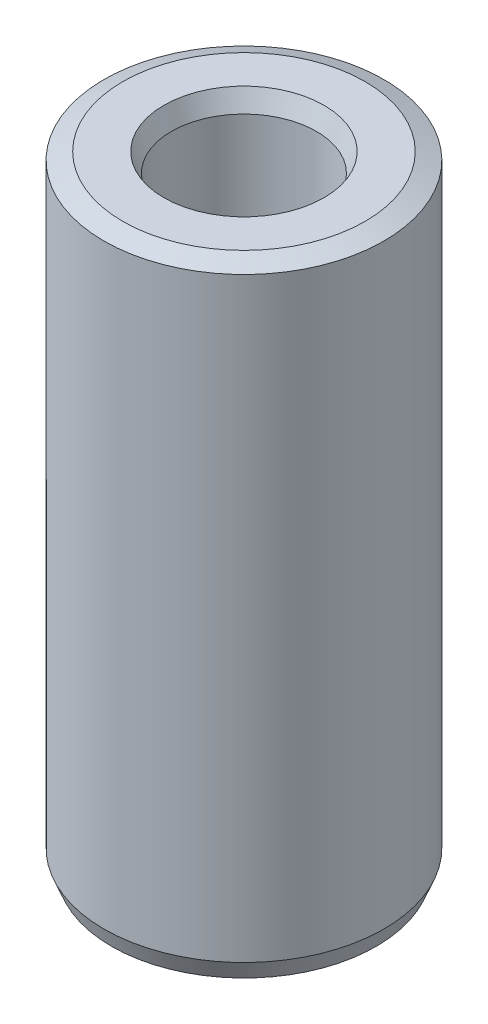
ISO-10303-21;
HEADER;
FILE_DESCRIPTION(('STEP AP214'),'2;1');
FILE_NAME('part.step','',(''),(''),'','','');
FILE_SCHEMA(('AUTOMOTIVE_DESIGN { 1 0 10303 214 1 1 1 1 }'));
ENDSEC;
DATA;
#1=APPLICATION_CONTEXT('core data for automotive mechanical design processes');
#2=APPLICATION_PROTOCOL_DEFINITION('international standard','automotive_design',2000,#1);
#3=PRODUCT_CONTEXT('',#1,'mechanical');
#4=PRODUCT('Part','Part','',(#3));
#5=PRODUCT_RELATED_PRODUCT_CATEGORY('part','',(#4));
#6=PRODUCT_DEFINITION_FORMATION('','',#4);
#7=PRODUCT_DEFINITION_CONTEXT('part definition',#1,'design');
#8=PRODUCT_DEFINITION('design','',#6,#7);
#9=PRODUCT_DEFINITION_SHAPE('','',#8);
#10=(LENGTH_UNIT() NAMED_UNIT(*) SI_UNIT(.MILLI.,.METRE.));
#11=(NAMED_UNIT(*) PLANE_ANGLE_UNIT() SI_UNIT($,.RADIAN.));
#12=(NAMED_UNIT(*) SI_UNIT($,.STERADIAN.) SOLID_ANGLE_UNIT());
#13=UNCERTAINTY_MEASURE_WITH_UNIT(LENGTH_MEASURE(1.E-05),#10,'distance_accuracy_value','');
#14=(GEOMETRIC_REPRESENTATION_CONTEXT(3) GLOBAL_UNCERTAINTY_ASSIGNED_CONTEXT((#13)) GLOBAL_UNIT_ASSIGNED_CONTEXT((#10,
#11,#12)) REPRESENTATION_CONTEXT('',''));
#15=CARTESIAN_POINT('',(0.,0.,0.));
#16=DIRECTION('',(0.,0.,1.));
#17=DIRECTION('',(1.,0.,0.));
#18=AXIS2_PLACEMENT_3D('',#15,#16,#17);
#19=CARTESIAN_POINT('',(0.,144.508683664438,0.));
#20=DIRECTION('',(0.,-1.,0.));
#21=DIRECTION('',(0.,0.,-1.));
#22=AXIS2_PLACEMENT_3D('',#19,#20,#21);
#23=CYLINDRICAL_SURFACE('',#22,32.5);
#24=CARTESIAN_POINT('',(0.,4.36969386151803,0.));
#25=DIRECTION('',(0.,1.,0.));
#26=DIRECTION('',(0.,0.,1.));
#27=AXIS2_PLACEMENT_3D('',#24,#25,#26);
#28=CIRCLE('',#27,32.5);
#29=CARTESIAN_POINT('',(0.,4.36969386151803,32.5));
#30=VERTEX_POINT('',#29);
#31=EDGE_CURVE('E10',#30,#30,#28,.T.);
#32=ORIENTED_EDGE('',*,*,#31,.T.);
#33=EDGE_LOOP('',(#32));
#34=FACE_BOUND('',#33,.T.);
#35=CARTESIAN_POINT('',(0.,142.746450942255,0.));
#36=DIRECTION('',(0.,1.,0.));
#37=DIRECTION('',(0.,0.,1.));
#38=AXIS2_PLACEMENT_3D('',#35,#36,#37);
#39=CIRCLE('',#38,32.5);
#40=CARTESIAN_POINT('',(0.,142.746450942255,32.5));
#41=VERTEX_POINT('',#40);
#42=EDGE_CURVE('E50',#41,#41,#39,.F.);
#43=ORIENTED_EDGE('',*,*,#42,.T.);
#44=EDGE_LOOP('',(#43));
#45=FACE_BOUND('',#44,.T.);
#46=ADVANCED_FACE('F39',(#34,#45),#23,.T.);
#47=CARTESIAN_POINT('',(0.,144.508683664438,0.));
#48=DIRECTION('',(0.,1.,0.));
#49=DIRECTION('',(0.,0.,1.));
#50=AXIS2_PLACEMENT_3D('',#47,#48,#49);
#51=PLANE('',#50);
#52=CARTESIAN_POINT('',(0.,144.508683664438,0.));
#53=DIRECTION('',(0.,1.,0.));
#54=DIRECTION('',(0.,0.,1.));
#55=AXIS2_PLACEMENT_3D('',#52,#53,#54);
#56=CIRCLE('',#55,18.5996014869327);
#57=CARTESIAN_POINT('',(0.,144.508683664438,18.5996014869327));
#58=VERTEX_POINT('',#57);
#59=EDGE_CURVE('E58',#58,#58,#56,.F.);
#60=ORIENTED_EDGE('',*,*,#59,.T.);
#61=EDGE_LOOP('',(#60));
#62=FACE_BOUND('',#61,.T.);
#63=CARTESIAN_POINT('',(0.,144.508683664438,0.));
#64=DIRECTION('',(0.,1.,0.));
#65=DIRECTION('',(0.,0.,1.));
#66=AXIS2_PLACEMENT_3D('',#63,#64,#65);
#67=CIRCLE('',#66,28.1303061384821);
#68=CARTESIAN_POINT('',(0.,144.508683664438,28.1303061384821));
#69=VERTEX_POINT('',#68);
#70=EDGE_CURVE('E61',#69,#69,#67,.T.);
#71=ORIENTED_EDGE('',*,*,#70,.T.);
#72=EDGE_LOOP('',(#71));
#73=FACE_BOUND('',#72,.T.);
#74=ADVANCED_FACE('F88',(#62,#73),#51,.T.);
#75=CARTESIAN_POINT('',(0.,0.,0.));
#76=DIRECTION('',(0.,1.,0.));
#77=DIRECTION('',(0.,0.,1.));
#78=AXIS2_PLACEMENT_3D('',#75,#76,#77);
#79=PLANE('',#78);
#80=CARTESIAN_POINT('',(0.,0.,0.));
#81=DIRECTION('',(0.,1.,0.));
#82=DIRECTION('',(0.,0.,1.));
#83=AXIS2_PLACEMENT_3D('',#80,#81,#82);
#84=CIRCLE('',#83,21.2070626262679);
#85=CARTESIAN_POINT('',(0.,0.,21.2070626262679));
#86=VERTEX_POINT('',#85);
#87=EDGE_CURVE('E51',#86,#86,#84,.T.);
#88=ORIENTED_EDGE('',*,*,#87,.T.);
#89=EDGE_LOOP('',(#88));
#90=FACE_BOUND('',#89,.T.);
#91=CARTESIAN_POINT('',(0.,0.,0.));
#92=DIRECTION('',(0.,1.,0.));
#93=DIRECTION('',(0.,0.,1.));
#94=AXIS2_PLACEMENT_3D('',#91,#92,#93);
#95=CIRCLE('',#94,30.7377672778172);
#96=CARTESIAN_POINT('',(0.,0.,30.7377672778172));
#97=VERTEX_POINT('',#96);
#98=EDGE_CURVE('E54',#97,#97,#95,.F.);
#99=ORIENTED_EDGE('',*,*,#98,.T.);
#100=EDGE_LOOP('',(#99));
#101=FACE_BOUND('',#100,.T.);
#102=ADVANCED_FACE('F83',(#90,#101),#79,.F.);
#103=CARTESIAN_POINT('',(0.,144.508683664438,0.));
#104=DIRECTION('',(0.,-1.,0.));
#105=DIRECTION('',(0.,0.,-1.));
#106=AXIS2_PLACEMENT_3D('',#103,#104,#105);
#107=CYLINDRICAL_SURFACE('',#106,16.8373687647499);
#108=CARTESIAN_POINT('',(0.,140.13898980292,0.));
#109=DIRECTION('',(0.,1.,0.));
#110=DIRECTION('',(0.,0.,1.));
#111=AXIS2_PLACEMENT_3D('',#108,#109,#110);
#112=CIRCLE('',#111,16.8373687647499);
#113=CARTESIAN_POINT('',(0.,140.13898980292,16.8373687647499));
#114=VERTEX_POINT('',#113);
#115=EDGE_CURVE('E67',#114,#114,#112,.T.);
#116=ORIENTED_EDGE('',*,*,#115,.T.);
#117=EDGE_LOOP('',(#116));
#118=FACE_BOUND('',#117,.T.);
#119=CARTESIAN_POINT('',(0.,1.76223272218276,0.));
#120=DIRECTION('',(0.,1.,0.));
#121=DIRECTION('',(0.,0.,1.));
#122=AXIS2_PLACEMENT_3D('',#119,#120,#121);
#123=CIRCLE('',#122,16.8373687647499);
#124=CARTESIAN_POINT('',(0.,1.76223272218276,16.8373687647499));
#125=VERTEX_POINT('',#124);
#126=EDGE_CURVE('E69',#125,#125,#123,.F.);
#127=ORIENTED_EDGE('',*,*,#126,.T.);
#128=EDGE_LOOP('',(#127));
#129=FACE_BOUND('',#128,.T.);
#130=ADVANCED_FACE('F71',(#118,#129),#107,.F.);
#131=CARTESIAN_POINT('',(0.,140.13898980292,0.));
#132=DIRECTION('',(0.,1.,0.));
#133=DIRECTION('',(0.,0.,1.));
#134=AXIS2_PLACEMENT_3D('',#131,#132,#133);
#135=CONICAL_SURFACE('',#134,16.8373687647499,0.383335206221912);
#136=ORIENTED_EDGE('',*,*,#59,.F.);
#137=EDGE_LOOP('',(#136));
#138=FACE_BOUND('',#137,.T.);
#139=ORIENTED_EDGE('',*,*,#115,.F.);
#140=EDGE_LOOP('',(#139));
#141=FACE_BOUND('',#140,.T.);
#142=ADVANCED_FACE('F77',(#138,#141),#135,.F.);
#143=CARTESIAN_POINT('',(0.,0.,0.));
#144=DIRECTION('',(0.,-1.,0.));
#145=DIRECTION('',(0.,0.,-1.));
#146=AXIS2_PLACEMENT_3D('',#143,#144,#145);
#147=CONICAL_SURFACE('',#146,21.2070626262679,1.18746112057298);
#148=ORIENTED_EDGE('',*,*,#126,.F.);
#149=EDGE_LOOP('',(#148));
#150=FACE_BOUND('',#149,.T.);
#151=ORIENTED_EDGE('',*,*,#87,.F.);
#152=EDGE_LOOP('',(#151));
#153=FACE_BOUND('',#152,.T.);
#154=ADVANCED_FACE('F73',(#150,#153),#147,.F.);
#155=CARTESIAN_POINT('',(0.,4.36969386151803,0.));
#156=DIRECTION('',(0.,1.,0.));
#157=DIRECTION('',(0.,0.,1.));
#158=AXIS2_PLACEMENT_3D('',#155,#156,#157);
#159=CONICAL_SURFACE('',#158,32.5,0.383335206221917);
#160=ORIENTED_EDGE('',*,*,#98,.F.);
#161=EDGE_LOOP('',(#160));
#162=FACE_BOUND('',#161,.T.);
#163=ORIENTED_EDGE('',*,*,#31,.F.);
#164=EDGE_LOOP('',(#163));
#165=FACE_BOUND('',#164,.T.);
#166=ADVANCED_FACE('F76',(#162,#165),#159,.T.);
#167=CARTESIAN_POINT('',(0.,144.508683664438,0.));
#168=DIRECTION('',(0.,-1.,0.));
#169=DIRECTION('',(0.,0.,-1.));
#170=AXIS2_PLACEMENT_3D('',#167,#168,#169);
#171=CONICAL_SURFACE('',#170,28.1303061384821,1.18746112057298);
#172=ORIENTED_EDGE('',*,*,#42,.F.);
#173=EDGE_LOOP('',(#172));
#174=FACE_BOUND('',#173,.T.);
#175=ORIENTED_EDGE('',*,*,#70,.F.);
#176=EDGE_LOOP('',(#175));
#177=FACE_BOUND('',#176,.T.);
#178=ADVANCED_FACE('F45',(#174,#177),#171,.T.);
#179=CLOSED_SHELL('',(#46,#74,#102,#130,#142,#154,#166,#178));
#180=MANIFOLD_SOLID_BREP('B2',#179);
#181=ADVANCED_BREP_SHAPE_REPRESENTATION('',(#18,#180),#14);
#182=SHAPE_DEFINITION_REPRESENTATION(#9,#181);
ENDSEC;
END-ISO-10303-21;
